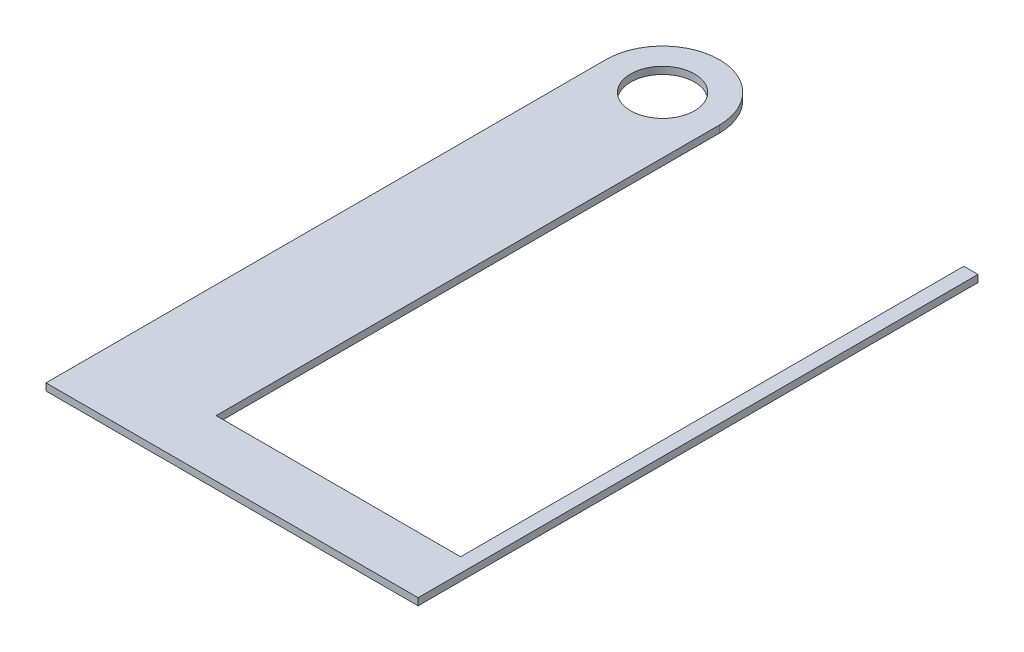
ISO-10303-21;
HEADER;
FILE_DESCRIPTION(('STEP AP214'),'2;1');
FILE_NAME('part.step','',(''),(''),'','','');
FILE_SCHEMA(('AUTOMOTIVE_DESIGN { 1 0 10303 214 1 1 1 1 }'));
ENDSEC;
DATA;
#1=APPLICATION_CONTEXT('core data for automotive mechanical design processes');
#2=APPLICATION_PROTOCOL_DEFINITION('international standard','automotive_design',2000,#1);
#3=PRODUCT_CONTEXT('',#1,'mechanical');
#4=PRODUCT('Part','Part','',(#3));
#5=PRODUCT_RELATED_PRODUCT_CATEGORY('part','',(#4));
#6=PRODUCT_DEFINITION_FORMATION('','',#4);
#7=PRODUCT_DEFINITION_CONTEXT('part definition',#1,'design');
#8=PRODUCT_DEFINITION('design','',#6,#7);
#9=PRODUCT_DEFINITION_SHAPE('','',#8);
#10=(LENGTH_UNIT() NAMED_UNIT(*) SI_UNIT(.MILLI.,.METRE.));
#11=(NAMED_UNIT(*) PLANE_ANGLE_UNIT() SI_UNIT($,.RADIAN.));
#12=(NAMED_UNIT(*) SI_UNIT($,.STERADIAN.) SOLID_ANGLE_UNIT());
#13=UNCERTAINTY_MEASURE_WITH_UNIT(LENGTH_MEASURE(1.E-05),#10,'distance_accuracy_value','');
#14=(GEOMETRIC_REPRESENTATION_CONTEXT(3) GLOBAL_UNCERTAINTY_ASSIGNED_CONTEXT((#13)) GLOBAL_UNIT_ASSIGNED_CONTEXT((#10,
#11,#12)) REPRESENTATION_CONTEXT('',''));
#15=CARTESIAN_POINT('',(0.,0.,0.));
#16=DIRECTION('',(0.,0.,1.));
#17=DIRECTION('',(1.,0.,0.));
#18=AXIS2_PLACEMENT_3D('',#15,#16,#17);
#19=CARTESIAN_POINT('',(0.,3.175,0.));
#20=DIRECTION('',(0.,1.,0.));
#21=DIRECTION('',(0.,0.,1.));
#22=AXIS2_PLACEMENT_3D('',#19,#20,#21);
#23=PLANE('',#22);
#24=CARTESIAN_POINT('',(0.,3.175,0.));
#25=DIRECTION('',(0.,1.,0.));
#26=DIRECTION('',(0.,0.,1.));
#27=AXIS2_PLACEMENT_3D('',#24,#25,#26);
#28=CIRCLE('',#27,25.4);
#29=CARTESIAN_POINT('',(25.4,3.175,0.));
#30=VERTEX_POINT('',#29);
#31=CARTESIAN_POINT('',(-25.4,3.175,0.));
#32=VERTEX_POINT('',#31);
#33=EDGE_CURVE('E153',#30,#32,#28,.T.);
#34=ORIENTED_EDGE('',*,*,#33,.T.);
#35=DIRECTION('',(0.,0.,1.));
#36=VECTOR('',#35,1.);
#37=CARTESIAN_POINT('',(-25.4,3.175,0.));
#38=LINE('',#37,#36);
#39=CARTESIAN_POINT('',(-25.4,3.175,250.825));
#40=VERTEX_POINT('',#39);
#41=EDGE_CURVE('E101',#32,#40,#38,.T.);
#42=ORIENTED_EDGE('',*,*,#41,.T.);
#43=DIRECTION('',(1.,0.,0.));
#44=VECTOR('',#43,1.);
#45=CARTESIAN_POINT('',(-25.4,3.175,250.825));
#46=LINE('',#45,#44);
#47=CARTESIAN_POINT('',(141.2875,3.175,250.825));
#48=VERTEX_POINT('',#47);
#49=EDGE_CURVE('E168',#40,#48,#46,.T.);
#50=ORIENTED_EDGE('',*,*,#49,.T.);
#51=DIRECTION('',(0.,0.,-1.));
#52=VECTOR('',#51,1.);
#53=CARTESIAN_POINT('',(141.2875,3.175,250.825));
#54=LINE('',#53,#52);
#55=CARTESIAN_POINT('',(141.2875,3.175,0.));
#56=VERTEX_POINT('',#55);
#57=EDGE_CURVE('E181',#48,#56,#54,.T.);
#58=ORIENTED_EDGE('',*,*,#57,.T.);
#59=DIRECTION('',(-1.,0.,0.));
#60=VECTOR('',#59,1.);
#61=CARTESIAN_POINT('',(141.2875,3.175,0.));
#62=LINE('',#61,#60);
#63=CARTESIAN_POINT('',(134.9375,3.175,0.));
#64=VERTEX_POINT('',#63);
#65=EDGE_CURVE('E120',#56,#64,#62,.T.);
#66=ORIENTED_EDGE('',*,*,#65,.T.);
#67=DIRECTION('',(0.,0.,1.));
#68=VECTOR('',#67,1.);
#69=CARTESIAN_POINT('',(134.9375,3.175,0.));
#70=LINE('',#69,#68);
#71=CARTESIAN_POINT('',(134.9375,3.175,225.425));
#72=VERTEX_POINT('',#71);
#73=EDGE_CURVE('E114',#64,#72,#70,.T.);
#74=ORIENTED_EDGE('',*,*,#73,.T.);
#75=DIRECTION('',(-1.,0.,0.));
#76=VECTOR('',#75,1.);
#77=CARTESIAN_POINT('',(134.9375,3.175,225.425));
#78=LINE('',#77,#76);
#79=CARTESIAN_POINT('',(25.4,3.175,225.425));
#80=VERTEX_POINT('',#79);
#81=EDGE_CURVE('E118',#72,#80,#78,.T.);
#82=ORIENTED_EDGE('',*,*,#81,.T.);
#83=DIRECTION('',(0.,0.,-1.));
#84=VECTOR('',#83,1.);
#85=CARTESIAN_POINT('',(25.4,3.175,225.425));
#86=LINE('',#85,#84);
#87=EDGE_CURVE('E58',#80,#30,#86,.T.);
#88=ORIENTED_EDGE('',*,*,#87,.T.);
#89=EDGE_LOOP('',(#34,#42,#50,#58,#66,#74,#82,#88));
#90=FACE_BOUND('',#89,.T.);
#91=CARTESIAN_POINT('',(0.,3.175,0.));
#92=DIRECTION('',(0.,1.,0.));
#93=DIRECTION('',(0.,0.,1.));
#94=AXIS2_PLACEMENT_3D('',#91,#92,#93);
#95=CIRCLE('',#94,14.3129);
#96=CARTESIAN_POINT('',(0.,3.175,14.3129));
#97=VERTEX_POINT('',#96);
#98=EDGE_CURVE('E142',#97,#97,#95,.T.);
#99=ORIENTED_EDGE('',*,*,#98,.F.);
#100=EDGE_LOOP('',(#99));
#101=FACE_BOUND('',#100,.T.);
#102=ADVANCED_FACE('F41',(#90,#101),#23,.T.);
#103=CARTESIAN_POINT('',(0.,0.,0.));
#104=DIRECTION('',(0.,1.,0.));
#105=DIRECTION('',(0.,0.,1.));
#106=AXIS2_PLACEMENT_3D('',#103,#104,#105);
#107=PLANE('',#106);
#108=CARTESIAN_POINT('',(0.,0.,0.));
#109=DIRECTION('',(0.,1.,0.));
#110=DIRECTION('',(0.,0.,1.));
#111=AXIS2_PLACEMENT_3D('',#108,#109,#110);
#112=CIRCLE('',#111,25.4);
#113=CARTESIAN_POINT('',(25.4,0.,0.));
#114=VERTEX_POINT('',#113);
#115=CARTESIAN_POINT('',(-25.4,0.,0.));
#116=VERTEX_POINT('',#115);
#117=EDGE_CURVE('E138',#114,#116,#112,.T.);
#118=ORIENTED_EDGE('',*,*,#117,.F.);
#119=DIRECTION('',(0.,0.,-1.));
#120=VECTOR('',#119,1.);
#121=CARTESIAN_POINT('',(25.4,0.,225.425));
#122=LINE('',#121,#120);
#123=CARTESIAN_POINT('',(25.4,0.,225.425));
#124=VERTEX_POINT('',#123);
#125=EDGE_CURVE('E93',#124,#114,#122,.T.);
#126=ORIENTED_EDGE('',*,*,#125,.F.);
#127=DIRECTION('',(-1.,0.,0.));
#128=VECTOR('',#127,1.);
#129=CARTESIAN_POINT('',(134.9375,0.,225.425));
#130=LINE('',#129,#128);
#131=CARTESIAN_POINT('',(134.9375,0.,225.425));
#132=VERTEX_POINT('',#131);
#133=EDGE_CURVE('E87',#132,#124,#130,.T.);
#134=ORIENTED_EDGE('',*,*,#133,.F.);
#135=DIRECTION('',(0.,0.,1.));
#136=VECTOR('',#135,1.);
#137=CARTESIAN_POINT('',(134.9375,0.,0.));
#138=LINE('',#137,#136);
#139=CARTESIAN_POINT('',(134.9375,0.,0.));
#140=VERTEX_POINT('',#139);
#141=EDGE_CURVE('E128',#140,#132,#138,.T.);
#142=ORIENTED_EDGE('',*,*,#141,.F.);
#143=DIRECTION('',(-1.,0.,0.));
#144=VECTOR('',#143,1.);
#145=CARTESIAN_POINT('',(141.2875,0.,0.));
#146=LINE('',#145,#144);
#147=CARTESIAN_POINT('',(141.2875,0.,0.));
#148=VERTEX_POINT('',#147);
#149=EDGE_CURVE('E148',#148,#140,#146,.T.);
#150=ORIENTED_EDGE('',*,*,#149,.F.);
#151=DIRECTION('',(0.,0.,-1.));
#152=VECTOR('',#151,1.);
#153=CARTESIAN_POINT('',(141.2875,0.,250.825));
#154=LINE('',#153,#152);
#155=CARTESIAN_POINT('',(141.2875,0.,250.825));
#156=VERTEX_POINT('',#155);
#157=EDGE_CURVE('E146',#156,#148,#154,.T.);
#158=ORIENTED_EDGE('',*,*,#157,.F.);
#159=DIRECTION('',(1.,0.,0.));
#160=VECTOR('',#159,1.);
#161=CARTESIAN_POINT('',(-25.4,0.,250.825));
#162=LINE('',#161,#160);
#163=CARTESIAN_POINT('',(-25.4,0.,250.825));
#164=VERTEX_POINT('',#163);
#165=EDGE_CURVE('E144',#164,#156,#162,.T.);
#166=ORIENTED_EDGE('',*,*,#165,.F.);
#167=DIRECTION('',(0.,0.,1.));
#168=VECTOR('',#167,1.);
#169=CARTESIAN_POINT('',(-25.4,0.,0.));
#170=LINE('',#169,#168);
#171=EDGE_CURVE('E141',#116,#164,#170,.T.);
#172=ORIENTED_EDGE('',*,*,#171,.F.);
#173=EDGE_LOOP('',(#118,#126,#134,#142,#150,#158,#166,#172));
#174=FACE_BOUND('',#173,.T.);
#175=CARTESIAN_POINT('',(0.,0.,0.));
#176=DIRECTION('',(0.,1.,0.));
#177=DIRECTION('',(0.,0.,1.));
#178=AXIS2_PLACEMENT_3D('',#175,#176,#177);
#179=CIRCLE('',#178,14.3129);
#180=CARTESIAN_POINT('',(0.,0.,14.3129));
#181=VERTEX_POINT('',#180);
#182=EDGE_CURVE('E187',#181,#181,#179,.T.);
#183=ORIENTED_EDGE('',*,*,#182,.T.);
#184=EDGE_LOOP('',(#183));
#185=FACE_BOUND('',#184,.T.);
#186=ADVANCED_FACE('F172',(#174,#185),#107,.F.);
#187=CARTESIAN_POINT('',(0.,3.175,0.));
#188=DIRECTION('',(0.,-1.,0.));
#189=DIRECTION('',(0.,0.,-1.));
#190=AXIS2_PLACEMENT_3D('',#187,#188,#189);
#191=CYLINDRICAL_SURFACE('',#190,25.4);
#192=ORIENTED_EDGE('',*,*,#117,.T.);
#193=DIRECTION('',(0.,-1.,0.));
#194=VECTOR('',#193,1.);
#195=CARTESIAN_POINT('',(-25.4,3.175,0.));
#196=LINE('',#195,#194);
#197=EDGE_CURVE('E11',#32,#116,#196,.T.);
#198=ORIENTED_EDGE('',*,*,#197,.F.);
#199=ORIENTED_EDGE('',*,*,#33,.F.);
#200=DIRECTION('',(0.,-1.,0.));
#201=VECTOR('',#200,1.);
#202=CARTESIAN_POINT('',(25.4,3.175,0.));
#203=LINE('',#202,#201);
#204=EDGE_CURVE('E134',#30,#114,#203,.T.);
#205=ORIENTED_EDGE('',*,*,#204,.T.);
#206=EDGE_LOOP('',(#192,#198,#199,#205));
#207=FACE_BOUND('',#206,.T.);
#208=ADVANCED_FACE('F43',(#207),#191,.T.);
#209=CARTESIAN_POINT('',(-25.4,3.175,0.));
#210=DIRECTION('',(1.,0.,0.));
#211=DIRECTION('',(0.,0.,-1.));
#212=AXIS2_PLACEMENT_3D('',#209,#210,#211);
#213=PLANE('',#212);
#214=ORIENTED_EDGE('',*,*,#171,.T.);
#215=DIRECTION('',(0.,-1.,0.));
#216=VECTOR('',#215,1.);
#217=CARTESIAN_POINT('',(-25.4,3.175,250.825));
#218=LINE('',#217,#216);
#219=EDGE_CURVE('E50',#40,#164,#218,.T.);
#220=ORIENTED_EDGE('',*,*,#219,.F.);
#221=ORIENTED_EDGE('',*,*,#41,.F.);
#222=ORIENTED_EDGE('',*,*,#197,.T.);
#223=EDGE_LOOP('',(#214,#220,#221,#222));
#224=FACE_BOUND('',#223,.T.);
#225=ADVANCED_FACE('F215',(#224),#213,.F.);
#226=CARTESIAN_POINT('',(-25.4,3.175,250.825));
#227=DIRECTION('',(0.,0.,-1.));
#228=DIRECTION('',(-1.,0.,0.));
#229=AXIS2_PLACEMENT_3D('',#226,#227,#228);
#230=PLANE('',#229);
#231=ORIENTED_EDGE('',*,*,#165,.T.);
#232=DIRECTION('',(0.,-1.,0.));
#233=VECTOR('',#232,1.);
#234=CARTESIAN_POINT('',(141.2875,3.175,250.825));
#235=LINE('',#234,#233);
#236=EDGE_CURVE('E160',#48,#156,#235,.T.);
#237=ORIENTED_EDGE('',*,*,#236,.F.);
#238=ORIENTED_EDGE('',*,*,#49,.F.);
#239=ORIENTED_EDGE('',*,*,#219,.T.);
#240=EDGE_LOOP('',(#231,#237,#238,#239));
#241=FACE_BOUND('',#240,.T.);
#242=ADVANCED_FACE('F166',(#241),#230,.F.);
#243=CARTESIAN_POINT('',(141.2875,3.175,250.825));
#244=DIRECTION('',(-1.,0.,0.));
#245=DIRECTION('',(0.,0.,1.));
#246=AXIS2_PLACEMENT_3D('',#243,#244,#245);
#247=PLANE('',#246);
#248=ORIENTED_EDGE('',*,*,#157,.T.);
#249=DIRECTION('',(0.,-1.,0.));
#250=VECTOR('',#249,1.);
#251=CARTESIAN_POINT('',(141.2875,3.175,0.));
#252=LINE('',#251,#250);
#253=EDGE_CURVE('E157',#56,#148,#252,.T.);
#254=ORIENTED_EDGE('',*,*,#253,.F.);
#255=ORIENTED_EDGE('',*,*,#57,.F.);
#256=ORIENTED_EDGE('',*,*,#236,.T.);
#257=EDGE_LOOP('',(#248,#254,#255,#256));
#258=FACE_BOUND('',#257,.T.);
#259=ADVANCED_FACE('F177',(#258),#247,.F.);
#260=CARTESIAN_POINT('',(141.2875,3.175,0.));
#261=DIRECTION('',(0.,0.,1.));
#262=DIRECTION('',(1.,0.,0.));
#263=AXIS2_PLACEMENT_3D('',#260,#261,#262);
#264=PLANE('',#263);
#265=ORIENTED_EDGE('',*,*,#149,.T.);
#266=DIRECTION('',(0.,-1.,0.));
#267=VECTOR('',#266,1.);
#268=CARTESIAN_POINT('',(134.9375,3.175,0.));
#269=LINE('',#268,#267);
#270=EDGE_CURVE('E129',#64,#140,#269,.T.);
#271=ORIENTED_EDGE('',*,*,#270,.F.);
#272=ORIENTED_EDGE('',*,*,#65,.F.);
#273=ORIENTED_EDGE('',*,*,#253,.T.);
#274=EDGE_LOOP('',(#265,#271,#272,#273));
#275=FACE_BOUND('',#274,.T.);
#276=ADVANCED_FACE('F180',(#275),#264,.F.);
#277=CARTESIAN_POINT('',(134.9375,3.175,0.));
#278=DIRECTION('',(1.,0.,0.));
#279=DIRECTION('',(0.,0.,-1.));
#280=AXIS2_PLACEMENT_3D('',#277,#278,#279);
#281=PLANE('',#280);
#282=ORIENTED_EDGE('',*,*,#141,.T.);
#283=DIRECTION('',(0.,-1.,0.));
#284=VECTOR('',#283,1.);
#285=CARTESIAN_POINT('',(134.9375,3.175,225.425));
#286=LINE('',#285,#284);
#287=EDGE_CURVE('E125',#72,#132,#286,.T.);
#288=ORIENTED_EDGE('',*,*,#287,.F.);
#289=ORIENTED_EDGE('',*,*,#73,.F.);
#290=ORIENTED_EDGE('',*,*,#270,.T.);
#291=EDGE_LOOP('',(#282,#288,#289,#290));
#292=FACE_BOUND('',#291,.T.);
#293=ADVANCED_FACE('F126',(#292),#281,.F.);
#294=CARTESIAN_POINT('',(134.9375,3.175,225.425));
#295=DIRECTION('',(0.,0.,1.));
#296=DIRECTION('',(1.,0.,0.));
#297=AXIS2_PLACEMENT_3D('',#294,#295,#296);
#298=PLANE('',#297);
#299=ORIENTED_EDGE('',*,*,#133,.T.);
#300=DIRECTION('',(0.,-1.,0.));
#301=VECTOR('',#300,1.);
#302=CARTESIAN_POINT('',(25.4,3.175,225.425));
#303=LINE('',#302,#301);
#304=EDGE_CURVE('E130',#80,#124,#303,.T.);
#305=ORIENTED_EDGE('',*,*,#304,.F.);
#306=ORIENTED_EDGE('',*,*,#81,.F.);
#307=ORIENTED_EDGE('',*,*,#287,.T.);
#308=EDGE_LOOP('',(#299,#305,#306,#307));
#309=FACE_BOUND('',#308,.T.);
#310=ADVANCED_FACE('F132',(#309),#298,.F.);
#311=CARTESIAN_POINT('',(25.4,3.175,225.425));
#312=DIRECTION('',(-1.,0.,0.));
#313=DIRECTION('',(0.,0.,1.));
#314=AXIS2_PLACEMENT_3D('',#311,#312,#313);
#315=PLANE('',#314);
#316=ORIENTED_EDGE('',*,*,#125,.T.);
#317=ORIENTED_EDGE('',*,*,#204,.F.);
#318=ORIENTED_EDGE('',*,*,#87,.F.);
#319=ORIENTED_EDGE('',*,*,#304,.T.);
#320=EDGE_LOOP('',(#316,#317,#318,#319));
#321=FACE_BOUND('',#320,.T.);
#322=ADVANCED_FACE('F203',(#321),#315,.F.);
#323=CARTESIAN_POINT('',(0.,3.175,0.));
#324=DIRECTION('',(0.,-1.,0.));
#325=DIRECTION('',(0.,0.,-1.));
#326=AXIS2_PLACEMENT_3D('',#323,#324,#325);
#327=CYLINDRICAL_SURFACE('',#326,14.3129);
#328=ORIENTED_EDGE('',*,*,#98,.T.);
#329=EDGE_LOOP('',(#328));
#330=FACE_BOUND('',#329,.T.);
#331=ORIENTED_EDGE('',*,*,#182,.F.);
#332=EDGE_LOOP('',(#331));
#333=FACE_BOUND('',#332,.T.);
#334=ADVANCED_FACE('F193',(#330,#333),#327,.F.);
#335=CLOSED_SHELL('',(#102,#186,#208,#225,#242,#259,#276,#293,#310,#322,#334));
#336=MANIFOLD_SOLID_BREP('B2',#335);
#337=ADVANCED_BREP_SHAPE_REPRESENTATION('',(#18,#336),#14);
#338=SHAPE_DEFINITION_REPRESENTATION(#9,#337);
ENDSEC;
END-ISO-10303-21;
